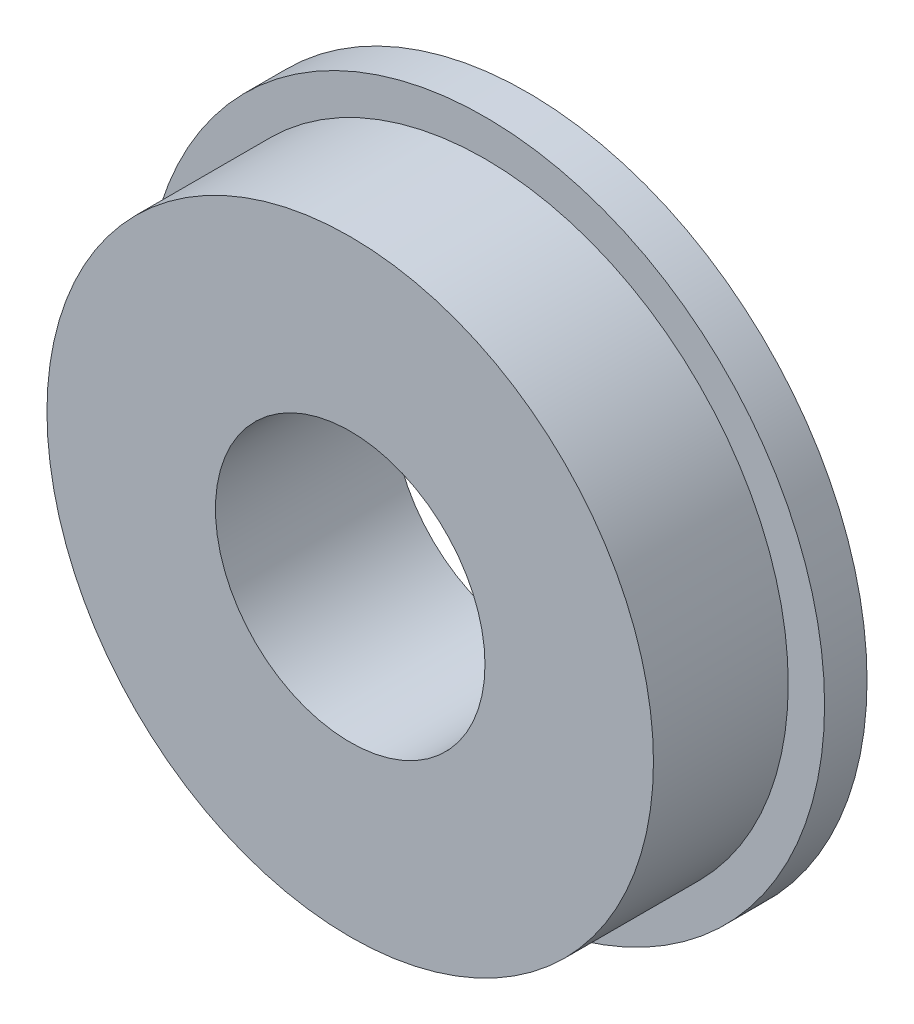
ISO-10303-21;
HEADER;
FILE_DESCRIPTION(('STEP AP214'),'2;1');
FILE_NAME('part.step','',(''),(''),'','','');
FILE_SCHEMA(('AUTOMOTIVE_DESIGN { 1 0 10303 214 1 1 1 1 }'));
ENDSEC;
DATA;
#1=APPLICATION_CONTEXT('core data for automotive mechanical design processes');
#2=APPLICATION_PROTOCOL_DEFINITION('international standard','automotive_design',2000,#1);
#3=PRODUCT_CONTEXT('',#1,'mechanical');
#4=PRODUCT('Part','Part','',(#3));
#5=PRODUCT_RELATED_PRODUCT_CATEGORY('part','',(#4));
#6=PRODUCT_DEFINITION_FORMATION('','',#4);
#7=PRODUCT_DEFINITION_CONTEXT('part definition',#1,'design');
#8=PRODUCT_DEFINITION('design','',#6,#7);
#9=PRODUCT_DEFINITION_SHAPE('','',#8);
#10=(LENGTH_UNIT() NAMED_UNIT(*) SI_UNIT(.MILLI.,.METRE.));
#11=(NAMED_UNIT(*) PLANE_ANGLE_UNIT() SI_UNIT($,.RADIAN.));
#12=(NAMED_UNIT(*) SI_UNIT($,.STERADIAN.) SOLID_ANGLE_UNIT());
#13=UNCERTAINTY_MEASURE_WITH_UNIT(LENGTH_MEASURE(1.E-05),#10,'distance_accuracy_value','');
#14=(GEOMETRIC_REPRESENTATION_CONTEXT(3) GLOBAL_UNCERTAINTY_ASSIGNED_CONTEXT((#13)) GLOBAL_UNIT_ASSIGNED_CONTEXT((#10,
#11,#12)) REPRESENTATION_CONTEXT('',''));
#15=CARTESIAN_POINT('',(0.,0.,0.));
#16=DIRECTION('',(0.,0.,1.));
#17=DIRECTION('',(1.,0.,0.));
#18=AXIS2_PLACEMENT_3D('',#15,#16,#17);
#19=CARTESIAN_POINT('',(0.,0.,2.));
#20=DIRECTION('',(0.,0.,-1.));
#21=DIRECTION('',(-1.,0.,0.));
#22=AXIS2_PLACEMENT_3D('',#19,#20,#21);
#23=CYLINDRICAL_SURFACE('',#22,16.);
#24=CARTESIAN_POINT('',(0.,0.,2.));
#25=DIRECTION('',(0.,0.,1.));
#26=DIRECTION('',(1.,0.,0.));
#27=AXIS2_PLACEMENT_3D('',#24,#25,#26);
#28=CIRCLE('',#27,16.);
#29=CARTESIAN_POINT('',(16.,0.,2.));
#30=VERTEX_POINT('',#29);
#31=EDGE_CURVE('E44',#30,#30,#28,.T.);
#32=ORIENTED_EDGE('',*,*,#31,.F.);
#33=EDGE_LOOP('',(#32));
#34=FACE_BOUND('',#33,.T.);
#35=CARTESIAN_POINT('',(0.,0.,0.));
#36=DIRECTION('',(0.,0.,1.));
#37=DIRECTION('',(1.,0.,0.));
#38=AXIS2_PLACEMENT_3D('',#35,#36,#37);
#39=CIRCLE('',#38,16.);
#40=CARTESIAN_POINT('',(16.,0.,0.));
#41=VERTEX_POINT('',#40);
#42=EDGE_CURVE('E40',#41,#41,#39,.T.);
#43=ORIENTED_EDGE('',*,*,#42,.T.);
#44=EDGE_LOOP('',(#43));
#45=FACE_BOUND('',#44,.T.);
#46=ADVANCED_FACE('F37',(#34,#45),#23,.T.);
#47=CARTESIAN_POINT('',(0.,0.,2.));
#48=DIRECTION('',(0.,0.,1.));
#49=DIRECTION('',(1.,0.,0.));
#50=AXIS2_PLACEMENT_3D('',#47,#48,#49);
#51=PLANE('',#50);
#52=CARTESIAN_POINT('',(0.,0.,2.));
#53=DIRECTION('',(0.,0.,1.));
#54=DIRECTION('',(1.,0.,0.));
#55=AXIS2_PLACEMENT_3D('',#52,#53,#54);
#56=CIRCLE('',#55,14.2875);
#57=CARTESIAN_POINT('',(14.2875,0.,2.));
#58=VERTEX_POINT('',#57);
#59=EDGE_CURVE('E10',#58,#58,#56,.T.);
#60=ORIENTED_EDGE('',*,*,#59,.F.);
#61=EDGE_LOOP('',(#60));
#62=FACE_BOUND('',#61,.T.);
#63=ORIENTED_EDGE('',*,*,#31,.T.);
#64=EDGE_LOOP('',(#63));
#65=FACE_BOUND('',#64,.T.);
#66=ADVANCED_FACE('F76',(#62,#65),#51,.T.);
#67=CARTESIAN_POINT('',(0.,0.,0.));
#68=DIRECTION('',(0.,0.,1.));
#69=DIRECTION('',(1.,0.,0.));
#70=AXIS2_PLACEMENT_3D('',#67,#68,#69);
#71=PLANE('',#70);
#72=CARTESIAN_POINT('',(0.,0.,0.));
#73=DIRECTION('',(0.,0.,1.));
#74=DIRECTION('',(1.,0.,0.));
#75=AXIS2_PLACEMENT_3D('',#72,#73,#74);
#76=CIRCLE('',#75,6.35);
#77=CARTESIAN_POINT('',(6.35,0.,0.));
#78=VERTEX_POINT('',#77);
#79=EDGE_CURVE('E53',#78,#78,#76,.F.);
#80=ORIENTED_EDGE('',*,*,#79,.F.);
#81=EDGE_LOOP('',(#80));
#82=FACE_BOUND('',#81,.T.);
#83=ORIENTED_EDGE('',*,*,#42,.F.);
#84=EDGE_LOOP('',(#83));
#85=FACE_BOUND('',#84,.T.);
#86=ADVANCED_FACE('F70',(#82,#85),#71,.F.);
#87=CARTESIAN_POINT('',(0.,0.,8.35));
#88=DIRECTION('',(0.,0.,-1.));
#89=DIRECTION('',(-1.,0.,0.));
#90=AXIS2_PLACEMENT_3D('',#87,#88,#89);
#91=CYLINDRICAL_SURFACE('',#90,14.2875);
#92=CARTESIAN_POINT('',(0.,0.,8.35));
#93=DIRECTION('',(0.,0.,1.));
#94=DIRECTION('',(1.,0.,0.));
#95=AXIS2_PLACEMENT_3D('',#92,#93,#94);
#96=CIRCLE('',#95,14.2875);
#97=CARTESIAN_POINT('',(14.2875,0.,8.35));
#98=VERTEX_POINT('',#97);
#99=EDGE_CURVE('E50',#98,#98,#96,.T.);
#100=ORIENTED_EDGE('',*,*,#99,.F.);
#101=EDGE_LOOP('',(#100));
#102=FACE_BOUND('',#101,.T.);
#103=ORIENTED_EDGE('',*,*,#59,.T.);
#104=EDGE_LOOP('',(#103));
#105=FACE_BOUND('',#104,.T.);
#106=ADVANCED_FACE('F65',(#102,#105),#91,.T.);
#107=CARTESIAN_POINT('',(0.,0.,8.35));
#108=DIRECTION('',(0.,0.,1.));
#109=DIRECTION('',(1.,0.,0.));
#110=AXIS2_PLACEMENT_3D('',#107,#108,#109);
#111=PLANE('',#110);
#112=CARTESIAN_POINT('',(0.,0.,8.35));
#113=DIRECTION('',(0.,0.,1.));
#114=DIRECTION('',(1.,0.,0.));
#115=AXIS2_PLACEMENT_3D('',#112,#113,#114);
#116=CIRCLE('',#115,6.35);
#117=CARTESIAN_POINT('',(6.35,0.,8.35));
#118=VERTEX_POINT('',#117);
#119=EDGE_CURVE('E56',#118,#118,#116,.T.);
#120=ORIENTED_EDGE('',*,*,#119,.F.);
#121=EDGE_LOOP('',(#120));
#122=FACE_BOUND('',#121,.T.);
#123=ORIENTED_EDGE('',*,*,#99,.T.);
#124=EDGE_LOOP('',(#123));
#125=FACE_BOUND('',#124,.T.);
#126=ADVANCED_FACE('F62',(#122,#125),#111,.T.);
#127=CARTESIAN_POINT('',(0.,0.,-17.9605122421383));
#128=DIRECTION('',(0.,0.,1.));
#129=DIRECTION('',(1.,0.,0.));
#130=AXIS2_PLACEMENT_3D('',#127,#128,#129);
#131=CYLINDRICAL_SURFACE('',#130,6.35);
#132=ORIENTED_EDGE('',*,*,#79,.T.);
#133=EDGE_LOOP('',(#132));
#134=FACE_BOUND('',#133,.T.);
#135=ORIENTED_EDGE('',*,*,#119,.T.);
#136=EDGE_LOOP('',(#135));
#137=FACE_BOUND('',#136,.T.);
#138=ADVANCED_FACE('F60',(#134,#137),#131,.F.);
#139=CLOSED_SHELL('',(#46,#66,#86,#106,#126,#138));
#140=MANIFOLD_SOLID_BREP('B2',#139);
#141=ADVANCED_BREP_SHAPE_REPRESENTATION('',(#18,#140),#14);
#142=SHAPE_DEFINITION_REPRESENTATION(#9,#141);
ENDSEC;
END-ISO-10303-21;
